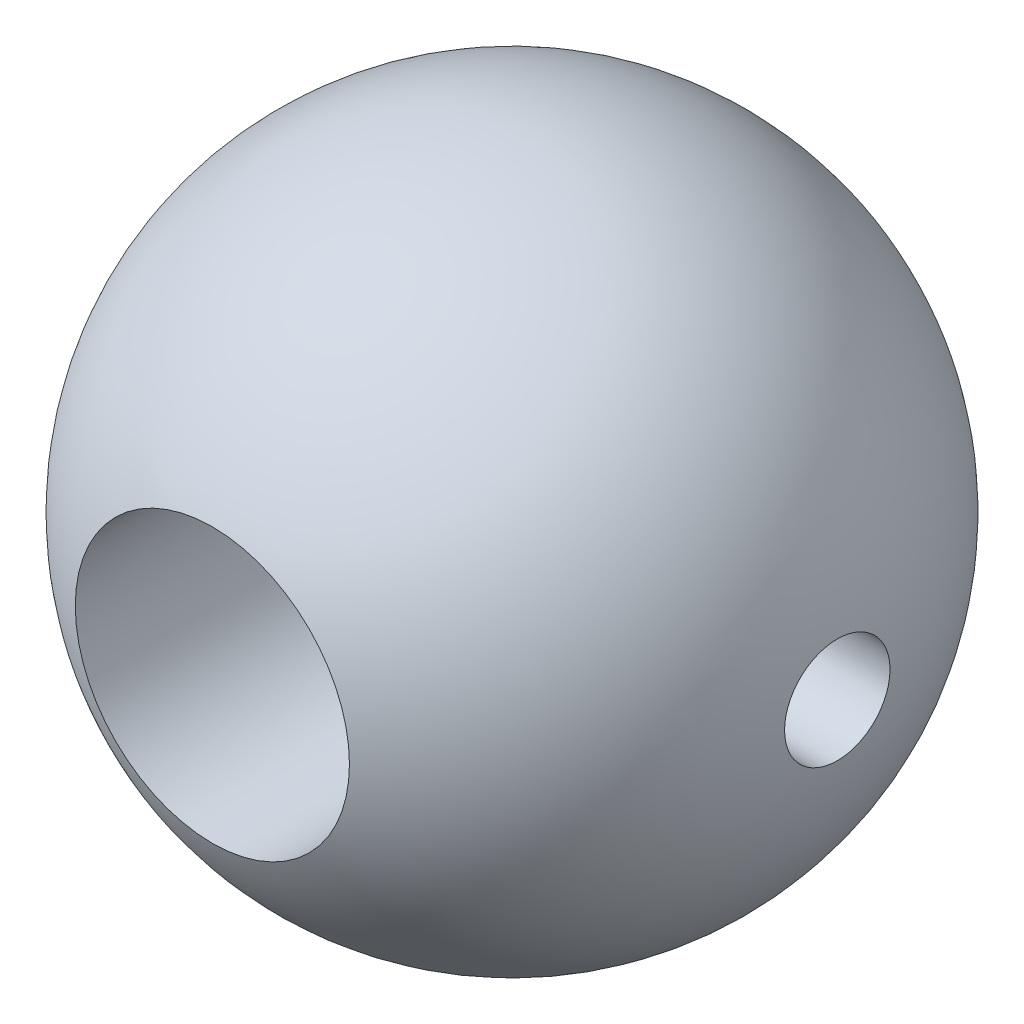
ISO-10303-21;
HEADER;
FILE_DESCRIPTION(('STEP AP214'),'2;1');
FILE_NAME('part.step','',(''),(''),'','','');
FILE_SCHEMA(('AUTOMOTIVE_DESIGN { 1 0 10303 214 1 1 1 1 }'));
ENDSEC;
DATA;
#1=APPLICATION_CONTEXT('core data for automotive mechanical design processes');
#2=APPLICATION_PROTOCOL_DEFINITION('international standard','automotive_design',2000,#1);
#3=PRODUCT_CONTEXT('',#1,'mechanical');
#4=PRODUCT('Part','Part','',(#3));
#5=PRODUCT_RELATED_PRODUCT_CATEGORY('part','',(#4));
#6=PRODUCT_DEFINITION_FORMATION('','',#4);
#7=PRODUCT_DEFINITION_CONTEXT('part definition',#1,'design');
#8=PRODUCT_DEFINITION('design','',#6,#7);
#9=PRODUCT_DEFINITION_SHAPE('','',#8);
#10=(LENGTH_UNIT() NAMED_UNIT(*) SI_UNIT(.MILLI.,.METRE.));
#11=(NAMED_UNIT(*) PLANE_ANGLE_UNIT() SI_UNIT($,.RADIAN.));
#12=(NAMED_UNIT(*) SI_UNIT($,.STERADIAN.) SOLID_ANGLE_UNIT());
#13=UNCERTAINTY_MEASURE_WITH_UNIT(LENGTH_MEASURE(1.E-05),#10,'distance_accuracy_value','');
#14=(GEOMETRIC_REPRESENTATION_CONTEXT(3) GLOBAL_UNCERTAINTY_ASSIGNED_CONTEXT((#13)) GLOBAL_UNIT_ASSIGNED_CONTEXT((#10,
#11,#12)) REPRESENTATION_CONTEXT('',''));
#15=CARTESIAN_POINT('',(0.,0.,0.));
#16=DIRECTION('',(0.,0.,1.));
#17=DIRECTION('',(1.,0.,0.));
#18=AXIS2_PLACEMENT_3D('',#15,#16,#17);
#19=CARTESIAN_POINT('',(0.,0.,0.));
#20=DIRECTION('',(0.,0.,1.));
#21=DIRECTION('',(1.,0.,0.));
#22=AXIS2_PLACEMENT_3D('',#19,#20,#21);
#23=SPHERICAL_SURFACE('',#22,9.525);
#24=CARTESIAN_POINT('',(9.40228956159084,0.,0.));
#25=DIRECTION('',(-1.,0.,0.));
#26=DIRECTION('',(0.,0.,1.));
#27=AXIS2_PLACEMENT_3D('',#24,#25,#26);
#28=CIRCLE('',#27,1.524);
#29=CARTESIAN_POINT('',(9.40228956159084,0.,1.524));
#30=VERTEX_POINT('',#29);
#31=EDGE_CURVE('E55',#30,#30,#28,.F.);
#32=ORIENTED_EDGE('',*,*,#31,.F.);
#33=EDGE_LOOP('',(#32));
#34=FACE_BOUND('',#33,.T.);
#35=CARTESIAN_POINT('',(-9.40228956159084,0.,0.));
#36=DIRECTION('',(1.,0.,0.));
#37=DIRECTION('',(0.,0.,-1.));
#38=AXIS2_PLACEMENT_3D('',#35,#36,#37);
#39=CIRCLE('',#38,1.524);
#40=CARTESIAN_POINT('',(-9.40228956159084,0.,-1.524));
#41=VERTEX_POINT('',#40);
#42=EDGE_CURVE('E88',#41,#41,#39,.F.);
#43=ORIENTED_EDGE('',*,*,#42,.F.);
#44=EDGE_LOOP('',(#43));
#45=FACE_BOUND('',#44,.T.);
#46=CARTESIAN_POINT('',(0.,0.,-8.66169794208965));
#47=DIRECTION('',(0.,0.,1.));
#48=DIRECTION('',(1.,0.,0.));
#49=AXIS2_PLACEMENT_3D('',#46,#47,#48);
#50=CIRCLE('',#49,3.9624);
#51=CARTESIAN_POINT('',(3.9624,0.,-8.66169794208965));
#52=VERTEX_POINT('',#51);
#53=EDGE_CURVE('E10',#52,#52,#50,.T.);
#54=ORIENTED_EDGE('',*,*,#53,.T.);
#55=EDGE_LOOP('',(#54));
#56=FACE_BOUND('',#55,.T.);
#57=CARTESIAN_POINT('',(0.,0.,8.66169794208965));
#58=DIRECTION('',(0.,0.,1.));
#59=DIRECTION('',(1.,0.,0.));
#60=AXIS2_PLACEMENT_3D('',#57,#58,#59);
#61=CIRCLE('',#60,3.9624);
#62=CARTESIAN_POINT('',(3.9624,0.,8.66169794208965));
#63=VERTEX_POINT('',#62);
#64=EDGE_CURVE('E49',#63,#63,#61,.T.);
#65=ORIENTED_EDGE('',*,*,#64,.F.);
#66=EDGE_LOOP('',(#65));
#67=FACE_BOUND('',#66,.T.);
#68=ADVANCED_FACE('F37',(#34,#45,#56,#67),#23,.T.);
#69=CARTESIAN_POINT('',(0.,0.,16.1721806966424));
#70=DIRECTION('',(0.,0.,1.));
#71=DIRECTION('',(1.,0.,0.));
#72=AXIS2_PLACEMENT_3D('',#69,#70,#71);
#73=CYLINDRICAL_SURFACE('',#72,3.9624);
#74=CARTESIAN_POINT('',(3.9624,0.,-1.524));
#75=CARTESIAN_POINT('',(3.96240282236448,-0.0823832117988372,-1.52400370187794));
#76=CARTESIAN_POINT('',(3.9598087234739,-0.164741768777532,-1.51729927050149));
#77=CARTESIAN_POINT('',(3.94972068881657,-0.326989375185106,-1.49077394725957));
#78=CARTESIAN_POINT('',(3.94222773383301,-0.406878915575161,-1.47095568086046));
#79=CARTESIAN_POINT('',(3.92314376757518,-0.561824430766083,-1.41901280241118));
#80=CARTESIAN_POINT('',(3.91156091508574,-0.636889679524329,-1.38691268040094));
#81=CARTESIAN_POINT('',(3.8854440514572,-0.780561764662452,-1.31144522873401));
#82=CARTESIAN_POINT('',(3.870909207656,-0.849166770805879,-1.26807471909546));
#83=CARTESIAN_POINT('',(3.83966184354326,-0.98101256888002,-1.16929230921134));
#84=CARTESIAN_POINT('',(3.82288551383333,-1.04392947203184,-1.11346850000974));
#85=CARTESIAN_POINT('',(3.78935155725586,-1.15977237232278,-0.992238550662686));
#86=CARTESIAN_POINT('',(3.77259393835564,-1.21269507625614,-0.926829264555594));
#87=CARTESIAN_POINT('',(3.7402419276997,-1.30916075487299,-0.785058132686643));
#88=CARTESIAN_POINT('',(3.72472213218244,-1.35223705026639,-0.708359998409526));
#89=CARTESIAN_POINT('',(3.69760145542617,-1.42473388922505,-0.548117780172543));
#90=CARTESIAN_POINT('',(3.68599891675835,-1.45416021020055,-0.464576610205255));
#91=CARTESIAN_POINT('',(3.66871136703309,-1.49722797065082,-0.296755269596639));
#92=CARTESIAN_POINT('',(3.66279482332923,-1.51148979612125,-0.212658988463573));
#93=CARTESIAN_POINT('',(3.65687393488689,-1.52576296000078,-0.0430746651980484));
#94=CARTESIAN_POINT('',(3.65686698267654,-1.52578058333758,0.0424127464794402));
#95=CARTESIAN_POINT('',(3.66256724984885,-1.51203755288371,0.20657165176932));
#96=CARTESIAN_POINT('',(3.6679117676401,-1.49915145862649,0.285331334592851));
#97=CARTESIAN_POINT('',(3.68310773897374,-1.46141728218942,0.439469832406262));
#98=CARTESIAN_POINT('',(3.69295990778208,-1.43656730156888,0.514848108755517));
#99=CARTESIAN_POINT('',(3.71627016055088,-1.37515191927401,0.661817306862471));
#100=CARTESIAN_POINT('',(3.72979486213247,-1.33836735410568,0.733305611191428));
#101=CARTESIAN_POINT('',(3.75890556932369,-1.25428011233081,0.869343170734574));
#102=CARTESIAN_POINT('',(3.77449231116486,-1.20697367486235,0.933889932545334));
#103=CARTESIAN_POINT('',(3.8073198642201,-1.09923386146956,1.0590331846954));
#104=CARTESIAN_POINT('',(3.82459954716737,-1.03810700856356,1.11902395627425));
#105=CARTESIAN_POINT('',(3.85791874689019,-0.906466903621836,1.22808837599519));
#106=CARTESIAN_POINT('',(3.87395805245793,-0.83595205856548,1.27716016754439));
#107=CARTESIAN_POINT('',(3.90333833544016,-0.685927471962975,1.36370875739182));
#108=CARTESIAN_POINT('',(3.91662873690382,-0.606285055645862,1.4009739768688));
#109=CARTESIAN_POINT('',(3.93863597195386,-0.441222180645674,1.46137341611381));
#110=CARTESIAN_POINT('',(3.94735494656839,-0.355804448033043,1.48451425187323));
#111=CARTESIAN_POINT('',(3.95885531697026,-0.186705772816221,1.51482075400228));
#112=CARTESIAN_POINT('',(3.96193927680725,-0.103191367253868,1.52280145261303));
#113=CARTESIAN_POINT('',(3.96276396835653,0.0640311989800715,1.5249469758272));
#114=CARTESIAN_POINT('',(3.96050595875748,0.147739309367495,1.5191150549954));
#115=CARTESIAN_POINT('',(3.95109955617244,0.309386259449006,1.49441301258624));
#116=CARTESIAN_POINT('',(3.94415471087811,0.387421086654448,1.47608525344331));
#117=CARTESIAN_POINT('',(3.92627995163935,0.539246742130953,1.4276349010864));
#118=CARTESIAN_POINT('',(3.91534952088689,0.613037018576838,1.3975107782088));
#119=CARTESIAN_POINT('',(3.89016948887267,0.756755993585938,1.32535110175376));
#120=CARTESIAN_POINT('',(3.87583038761299,0.826503172579756,1.2829862187554));
#121=CARTESIAN_POINT('',(3.84540747605239,0.958137098887165,1.1879170786935));
#122=CARTESIAN_POINT('',(3.82932300010427,1.02002082758326,1.13520887067599));
#123=CARTESIAN_POINT('',(3.79595470828284,1.13812848124458,1.01716651998345));
#124=CARTESIAN_POINT('',(3.77865763314025,1.19377602181441,0.951257916244385));
#125=CARTESIAN_POINT('',(3.74574808596595,1.29334553069202,0.810709842549428));
#126=CARTESIAN_POINT('',(3.73013580960979,1.33726613788419,0.736069360551102));
#127=CARTESIAN_POINT('',(3.70239766831843,1.41226133124071,0.579378441506777));
#128=CARTESIAN_POINT('',(3.6902936604239,1.44325588964251,0.497285565202505));
#129=CARTESIAN_POINT('',(3.67136265120496,1.49076377154682,0.328446014885112));
#130=CARTESIAN_POINT('',(3.6645321514174,1.50728669655996,0.241702467068044));
#131=CARTESIAN_POINT('',(3.65740189637462,1.52450115540884,0.0723055089107602));
#132=CARTESIAN_POINT('',(3.656694038775,1.52618214210213,-0.0102309284248388));
#133=CARTESIAN_POINT('',(3.66083421742896,1.5162240207463,-0.174346265948186));
#134=CARTESIAN_POINT('',(3.6656816676127,1.50458631778289,-0.255925266225766));
#135=CARTESIAN_POINT('',(3.68003871931458,1.46910635357731,-0.413001599884546));
#136=CARTESIAN_POINT('',(3.68938526513984,1.44568973790675,-0.48861128732933));
#137=CARTESIAN_POINT('',(3.7115846905006,1.38770023801291,-0.634867794092769));
#138=CARTESIAN_POINT('',(3.72443847714761,1.3531244671662,-0.705513323530822));
#139=CARTESIAN_POINT('',(3.75307237180445,1.2716214517031,-0.844012721058862));
#140=CARTESIAN_POINT('',(3.76897352779584,1.22412519875318,-0.911506376003606));
#141=CARTESIAN_POINT('',(3.80151257638812,1.11899135504502,-1.03788040403735));
#142=CARTESIAN_POINT('',(3.81815070787973,1.06135045762812,-1.0967579572024));
#143=CARTESIAN_POINT('',(3.85145039309786,0.933564789015123,-1.20772450919069));
#144=CARTESIAN_POINT('',(3.86805713408548,0.862888086373679,-1.25922027592957));
#145=CARTESIAN_POINT('',(3.89841533314912,0.713297326181135,-1.34960006003825));
#146=CARTESIAN_POINT('',(3.91216631178401,0.6343818888023,-1.38848196033755));
#147=CARTESIAN_POINT('',(3.93599907401198,0.46506435342489,-1.45432541383381));
#148=CARTESIAN_POINT('',(3.945782734099,0.374248702879133,-1.48034311564312));
#149=CARTESIAN_POINT('',(3.95897975534462,0.188943141245847,-1.51517336076205));
#150=CARTESIAN_POINT('',(3.96239676405589,0.0944553656738099,-1.52399575566154));
#151=CARTESIAN_POINT('',(3.9624,0.,-1.524));
#152=B_SPLINE_CURVE_WITH_KNOTS('',3,(#74,#75,#76,#77,#78,#79,#80,#81,#82,#83,#84,#85,#86,#87,
#88,#89,#90,#91,#92,#93,#94,#95,#96,#97,#98,#99,#100,#101,#102,#103,#104,#105,#106,#107,#108,
#109,#110,#111,#112,#113,#114,#115,#116,#117,#118,#119,#120,#121,#122,#123,#124,#125,#126,#127,
#128,#129,#130,#131,#132,#133,#134,#135,#136,#137,#138,#139,#140,#141,#142,#143,#144,#145,#146,
#147,#148,#149,#150,#151),.UNSPECIFIED.,.T.,.F.,(4,2,2,2,2,2,2,2,2,2,2,2,2,2,2,2,2,2,2,2,2,2,2,
2,2,2,2,2,2,2,2,2,2,2,2,2,2,2,4),(0.,0.24680106840237,0.493552740733196,0.739814932650704,
0.986146683950201,1.24232153853427,1.4985806590046,1.76521815741682,2.03174269715747,
2.2868861516139,2.54191702980778,2.78075881594744,3.01963851422272,3.26317996759628,
3.506808610957,3.76773245937027,4.02870063974561,4.29411083101894,4.55939660611672,
4.80996515665973,5.06047467347264,5.30075050438383,5.54105750277828,5.78855226921559,
6.03614175862901,6.29885045243913,6.56158962494338,6.82593214937829,7.09009915703976,
7.33651029381289,7.58289543727424,7.82095587089499,8.05907793483951,8.3101374962698,
8.56127904292735,8.82701319251129,9.09279191900839,9.37592062995942,9.65888708217246),.UNSPECIFIED.);
#153=CARTESIAN_POINT('',(3.9624,0.,-1.524));
#154=VERTEX_POINT('',#153);
#155=EDGE_CURVE('E40',#154,#154,#152,.T.);
#156=ORIENTED_EDGE('',*,*,#155,.F.);
#157=EDGE_LOOP('',(#156));
#158=FACE_BOUND('',#157,.T.);
#159=CARTESIAN_POINT('',(-3.9624,0.,-1.524));
#160=CARTESIAN_POINT('',(-3.96240282236448,0.0823832117988372,-1.52400370187794));
#161=CARTESIAN_POINT('',(-3.9598087234739,0.164741768777532,-1.51729927050149));
#162=CARTESIAN_POINT('',(-3.94972068881657,0.326989375185106,-1.49077394725957));
#163=CARTESIAN_POINT('',(-3.94222773383301,0.406878915575161,-1.47095568086046));
#164=CARTESIAN_POINT('',(-3.92314376757518,0.561824430766083,-1.41901280241118));
#165=CARTESIAN_POINT('',(-3.91156091508574,0.636889679524329,-1.38691268040094));
#166=CARTESIAN_POINT('',(-3.8854440514572,0.780561764662452,-1.31144522873401));
#167=CARTESIAN_POINT('',(-3.870909207656,0.849166770805879,-1.26807471909546));
#168=CARTESIAN_POINT('',(-3.83966184354326,0.98101256888002,-1.16929230921134));
#169=CARTESIAN_POINT('',(-3.82288551383333,1.04392947203184,-1.11346850000974));
#170=CARTESIAN_POINT('',(-3.78935155725586,1.15977237232278,-0.992238550662686));
#171=CARTESIAN_POINT('',(-3.77259393835564,1.21269507625614,-0.926829264555594));
#172=CARTESIAN_POINT('',(-3.7402419276997,1.30916075487299,-0.785058132686643));
#173=CARTESIAN_POINT('',(-3.72472213218244,1.35223705026639,-0.708359998409526));
#174=CARTESIAN_POINT('',(-3.69760145542617,1.42473388922505,-0.548117780172543));
#175=CARTESIAN_POINT('',(-3.68599891675835,1.45416021020055,-0.464576610205255));
#176=CARTESIAN_POINT('',(-3.66871136703309,1.49722797065082,-0.296755269596639));
#177=CARTESIAN_POINT('',(-3.66279482332923,1.51148979612125,-0.212658988463573));
#178=CARTESIAN_POINT('',(-3.65687393488689,1.52576296000078,-0.0430746651980484));
#179=CARTESIAN_POINT('',(-3.65686698267654,1.52578058333758,0.0424127464794402));
#180=CARTESIAN_POINT('',(-3.66256724984885,1.51203755288371,0.20657165176932));
#181=CARTESIAN_POINT('',(-3.6679117676401,1.49915145862649,0.285331334592851));
#182=CARTESIAN_POINT('',(-3.68310773897374,1.46141728218942,0.439469832406262));
#183=CARTESIAN_POINT('',(-3.69295990778208,1.43656730156888,0.514848108755517));
#184=CARTESIAN_POINT('',(-3.71627016055088,1.37515191927401,0.661817306862471));
#185=CARTESIAN_POINT('',(-3.72979486213247,1.33836735410568,0.733305611191428));
#186=CARTESIAN_POINT('',(-3.75890556932369,1.25428011233081,0.869343170734574));
#187=CARTESIAN_POINT('',(-3.77449231116486,1.20697367486235,0.933889932545334));
#188=CARTESIAN_POINT('',(-3.8073198642201,1.09923386146956,1.0590331846954));
#189=CARTESIAN_POINT('',(-3.82459954716737,1.03810700856356,1.11902395627425));
#190=CARTESIAN_POINT('',(-3.85791874689019,0.906466903621836,1.22808837599519));
#191=CARTESIAN_POINT('',(-3.87395805245793,0.83595205856548,1.27716016754439));
#192=CARTESIAN_POINT('',(-3.90333833544016,0.685927471962975,1.36370875739182));
#193=CARTESIAN_POINT('',(-3.91662873690382,0.606285055645862,1.4009739768688));
#194=CARTESIAN_POINT('',(-3.93863597195386,0.441222180645674,1.46137341611381));
#195=CARTESIAN_POINT('',(-3.94735494656839,0.355804448033043,1.48451425187323));
#196=CARTESIAN_POINT('',(-3.95885531697026,0.186705772816221,1.51482075400228));
#197=CARTESIAN_POINT('',(-3.96193927680725,0.103191367253868,1.52280145261303));
#198=CARTESIAN_POINT('',(-3.96276396835653,-0.0640311989800715,1.5249469758272));
#199=CARTESIAN_POINT('',(-3.96050595875748,-0.147739309367495,1.5191150549954));
#200=CARTESIAN_POINT('',(-3.95109955617244,-0.309386259449006,1.49441301258624));
#201=CARTESIAN_POINT('',(-3.94415471087811,-0.387421086654448,1.47608525344331));
#202=CARTESIAN_POINT('',(-3.92627995163935,-0.539246742130953,1.4276349010864));
#203=CARTESIAN_POINT('',(-3.91534952088689,-0.613037018576838,1.3975107782088));
#204=CARTESIAN_POINT('',(-3.89016948887267,-0.756755993585938,1.32535110175376));
#205=CARTESIAN_POINT('',(-3.87583038761299,-0.826503172579756,1.2829862187554));
#206=CARTESIAN_POINT('',(-3.84540747605239,-0.958137098887165,1.1879170786935));
#207=CARTESIAN_POINT('',(-3.82932300010427,-1.02002082758326,1.13520887067599));
#208=CARTESIAN_POINT('',(-3.79595470828284,-1.13812848124458,1.01716651998345));
#209=CARTESIAN_POINT('',(-3.77865763314025,-1.19377602181441,0.951257916244385));
#210=CARTESIAN_POINT('',(-3.74574808596595,-1.29334553069202,0.810709842549428));
#211=CARTESIAN_POINT('',(-3.73013580960979,-1.33726613788419,0.736069360551102));
#212=CARTESIAN_POINT('',(-3.70239766831843,-1.41226133124071,0.579378441506777));
#213=CARTESIAN_POINT('',(-3.6902936604239,-1.44325588964251,0.497285565202505));
#214=CARTESIAN_POINT('',(-3.67136265120496,-1.49076377154682,0.328446014885112));
#215=CARTESIAN_POINT('',(-3.6645321514174,-1.50728669655996,0.241702467068044));
#216=CARTESIAN_POINT('',(-3.65740189637462,-1.52450115540884,0.0723055089107602));
#217=CARTESIAN_POINT('',(-3.656694038775,-1.52618214210213,-0.0102309284248388));
#218=CARTESIAN_POINT('',(-3.66083421742896,-1.5162240207463,-0.174346265948186));
#219=CARTESIAN_POINT('',(-3.6656816676127,-1.50458631778289,-0.255925266225766));
#220=CARTESIAN_POINT('',(-3.68003871931458,-1.46910635357731,-0.413001599884546));
#221=CARTESIAN_POINT('',(-3.68938526513984,-1.44568973790675,-0.48861128732933));
#222=CARTESIAN_POINT('',(-3.7115846905006,-1.38770023801291,-0.634867794092769));
#223=CARTESIAN_POINT('',(-3.72443847714761,-1.3531244671662,-0.705513323530822));
#224=CARTESIAN_POINT('',(-3.75307237180445,-1.2716214517031,-0.844012721058862));
#225=CARTESIAN_POINT('',(-3.76897352779584,-1.22412519875318,-0.911506376003606));
#226=CARTESIAN_POINT('',(-3.80151257638812,-1.11899135504502,-1.03788040403735));
#227=CARTESIAN_POINT('',(-3.81815070787973,-1.06135045762812,-1.0967579572024));
#228=CARTESIAN_POINT('',(-3.85145039309786,-0.933564789015123,-1.20772450919069));
#229=CARTESIAN_POINT('',(-3.86805713408548,-0.862888086373679,-1.25922027592957));
#230=CARTESIAN_POINT('',(-3.89841533314912,-0.713297326181135,-1.34960006003825));
#231=CARTESIAN_POINT('',(-3.91216631178401,-0.6343818888023,-1.38848196033755));
#232=CARTESIAN_POINT('',(-3.93599907401198,-0.46506435342489,-1.45432541383381));
#233=CARTESIAN_POINT('',(-3.945782734099,-0.374248702879133,-1.48034311564312));
#234=CARTESIAN_POINT('',(-3.95897975534462,-0.188943141245847,-1.51517336076205));
#235=CARTESIAN_POINT('',(-3.96239676405589,-0.0944553656738099,-1.52399575566154));
#236=CARTESIAN_POINT('',(-3.9624,0.,-1.524));
#237=B_SPLINE_CURVE_WITH_KNOTS('',3,(#159,#160,#161,#162,#163,#164,#165,#166,#167,#168,#169,
#170,#171,#172,#173,#174,#175,#176,#177,#178,#179,#180,#181,#182,#183,#184,#185,#186,#187,#188,
#189,#190,#191,#192,#193,#194,#195,#196,#197,#198,#199,#200,#201,#202,#203,#204,#205,#206,#207,
#208,#209,#210,#211,#212,#213,#214,#215,#216,#217,#218,#219,#220,#221,#222,#223,#224,#225,#226,
#227,#228,#229,#230,#231,#232,#233,#234,#235,#236),.UNSPECIFIED.,.T.,.F.,(4,2,2,2,2,2,2,2,2,2,2,
2,2,2,2,2,2,2,2,2,2,2,2,2,2,2,2,2,2,2,2,2,2,2,2,2,2,2,4),(0.,0.24680106840237,0.493552740733196,
0.739814932650704,0.986146683950201,1.24232153853427,1.4985806590046,1.76521815741682,
2.03174269715747,2.2868861516139,2.54191702980778,2.78075881594744,3.01963851422272,
3.26317996759628,3.506808610957,3.76773245937027,4.02870063974561,4.29411083101894,
4.55939660611672,4.80996515665973,5.06047467347264,5.30075050438383,5.54105750277828,
5.78855226921559,6.03614175862901,6.29885045243913,6.56158962494338,6.82593214937829,
7.09009915703976,7.33651029381289,7.58289543727424,7.82095587089499,8.05907793483951,
8.3101374962698,8.56127904292735,8.82701319251129,9.09279191900839,9.37592062995942,
9.65888708217246),.UNSPECIFIED.);
#238=CARTESIAN_POINT('',(-3.9624,0.,-1.524));
#239=VERTEX_POINT('',#238);
#240=EDGE_CURVE('E58',#239,#239,#237,.T.);
#241=ORIENTED_EDGE('',*,*,#240,.F.);
#242=EDGE_LOOP('',(#241));
#243=FACE_BOUND('',#242,.T.);
#244=ORIENTED_EDGE('',*,*,#64,.T.);
#245=EDGE_LOOP('',(#244));
#246=FACE_BOUND('',#245,.T.);
#247=ORIENTED_EDGE('',*,*,#53,.F.);
#248=EDGE_LOOP('',(#247));
#249=FACE_BOUND('',#248,.T.);
#250=ADVANCED_FACE('F64',(#158,#243,#246,#249),#73,.F.);
#251=CARTESIAN_POINT('',(14.1130835462594,0.,0.));
#252=DIRECTION('',(1.,0.,0.));
#253=DIRECTION('',(0.,0.,-1.));
#254=AXIS2_PLACEMENT_3D('',#251,#252,#253);
#255=CYLINDRICAL_SURFACE('',#254,1.524);
#256=ORIENTED_EDGE('',*,*,#42,.T.);
#257=EDGE_LOOP('',(#256));
#258=FACE_BOUND('',#257,.T.);
#259=ORIENTED_EDGE('',*,*,#240,.T.);
#260=EDGE_LOOP('',(#259));
#261=FACE_BOUND('',#260,.T.);
#262=ADVANCED_FACE('F66',(#258,#261),#255,.F.);
#263=ORIENTED_EDGE('',*,*,#31,.T.);
#264=EDGE_LOOP('',(#263));
#265=FACE_BOUND('',#264,.T.);
#266=ORIENTED_EDGE('',*,*,#155,.T.);
#267=EDGE_LOOP('',(#266));
#268=FACE_BOUND('',#267,.T.);
#269=ADVANCED_FACE('F69',(#265,#268),#255,.F.);
#270=CLOSED_SHELL('',(#68,#250,#262,#269));
#271=MANIFOLD_SOLID_BREP('B2',#270);
#272=ADVANCED_BREP_SHAPE_REPRESENTATION('',(#18,#271),#14);
#273=SHAPE_DEFINITION_REPRESENTATION(#9,#272);
ENDSEC;
END-ISO-10303-21;
